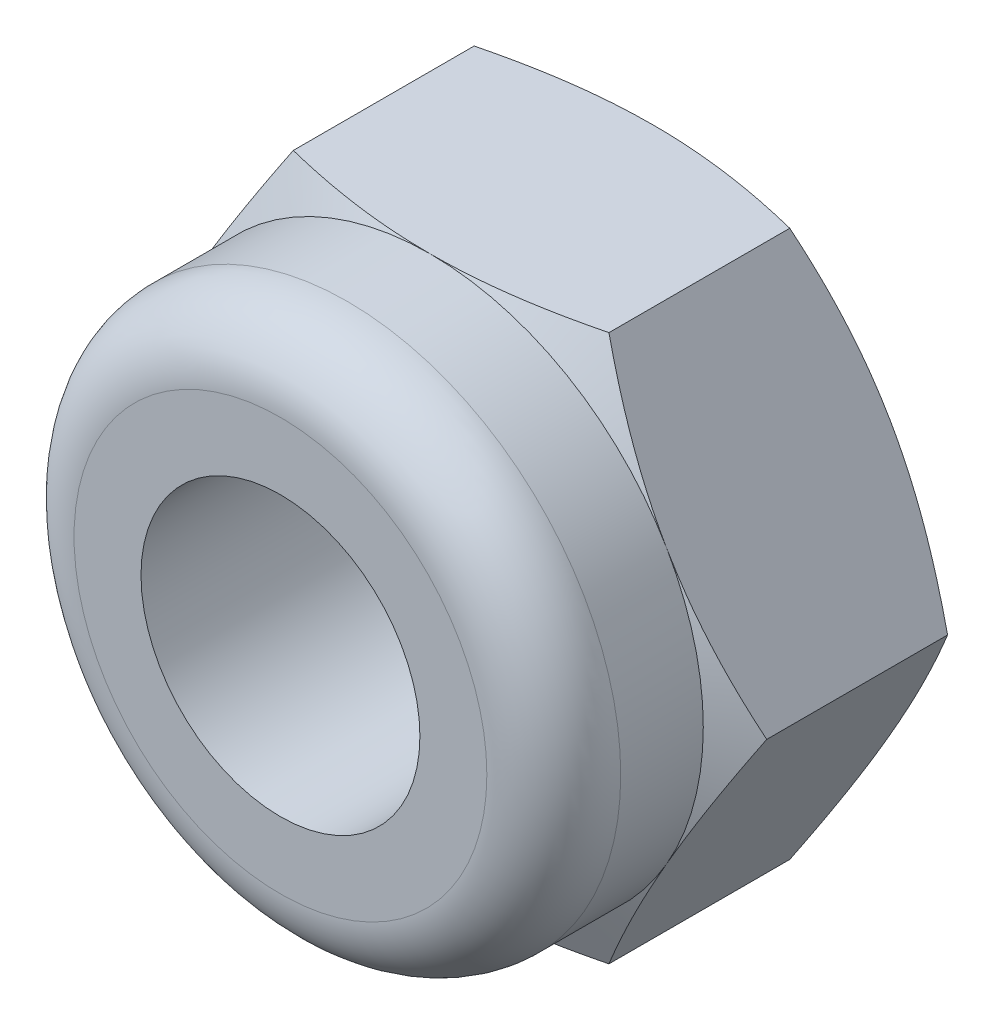
ISO-10303-21;
HEADER;
FILE_DESCRIPTION(('STEP AP214'),'2;1');
FILE_NAME('part.step','',(''),(''),'','','');
FILE_SCHEMA(('AUTOMOTIVE_DESIGN { 1 0 10303 214 1 1 1 1 }'));
ENDSEC;
DATA;
#1=APPLICATION_CONTEXT('core data for automotive mechanical design processes');
#2=APPLICATION_PROTOCOL_DEFINITION('international standard','automotive_design',2000,#1);
#3=PRODUCT_CONTEXT('',#1,'mechanical');
#4=PRODUCT('Part','Part','',(#3));
#5=PRODUCT_RELATED_PRODUCT_CATEGORY('part','',(#4));
#6=PRODUCT_DEFINITION_FORMATION('','',#4);
#7=PRODUCT_DEFINITION_CONTEXT('part definition',#1,'design');
#8=PRODUCT_DEFINITION('design','',#6,#7);
#9=PRODUCT_DEFINITION_SHAPE('','',#8);
#10=(LENGTH_UNIT() NAMED_UNIT(*) SI_UNIT(.MILLI.,.METRE.));
#11=(NAMED_UNIT(*) PLANE_ANGLE_UNIT() SI_UNIT($,.RADIAN.));
#12=(NAMED_UNIT(*) SI_UNIT($,.STERADIAN.) SOLID_ANGLE_UNIT());
#13=UNCERTAINTY_MEASURE_WITH_UNIT(LENGTH_MEASURE(1.E-05),#10,'distance_accuracy_value','');
#14=(GEOMETRIC_REPRESENTATION_CONTEXT(3) GLOBAL_UNCERTAINTY_ASSIGNED_CONTEXT((#13)) GLOBAL_UNIT_ASSIGNED_CONTEXT((#10,
#11,#12)) REPRESENTATION_CONTEXT('',''));
#15=CARTESIAN_POINT('',(0.,0.,0.));
#16=DIRECTION('',(0.,0.,1.));
#17=DIRECTION('',(1.,0.,0.));
#18=AXIS2_PLACEMENT_3D('',#15,#16,#17);
#19=CARTESIAN_POINT('',(0.,0.,0.));
#20=DIRECTION('',(0.,0.,1.));
#21=DIRECTION('',(1.,0.,0.));
#22=AXIS2_PLACEMENT_3D('',#19,#20,#21);
#23=PLANE('',#22);
#24=CARTESIAN_POINT('',(0.,0.,0.));
#25=DIRECTION('',(0.,0.,1.));
#26=DIRECTION('',(1.,0.,0.));
#27=AXIS2_PLACEMENT_3D('',#24,#25,#26);
#28=CIRCLE('',#27,1.55);
#29=CARTESIAN_POINT('',(1.55,0.,0.));
#30=VERTEX_POINT('',#29);
#31=EDGE_CURVE('E41',#30,#30,#28,.T.);
#32=ORIENTED_EDGE('',*,*,#31,.T.);
#33=EDGE_LOOP('',(#32));
#34=FACE_BOUND('',#33,.T.);
#35=CARTESIAN_POINT('',(0.,0.,0.));
#36=DIRECTION('',(0.,0.,1.));
#37=DIRECTION('',(1.,0.,0.));
#38=AXIS2_PLACEMENT_3D('',#35,#36,#37);
#39=CIRCLE('',#38,2.45);
#40=CARTESIAN_POINT('',(2.12176223927188,1.225,0.));
#41=VERTEX_POINT('',#40);
#42=CARTESIAN_POINT('',(0.,2.45,0.));
#43=VERTEX_POINT('',#42);
#44=EDGE_CURVE('E320',#41,#43,#39,.T.);
#45=ORIENTED_EDGE('',*,*,#44,.F.);
#46=CARTESIAN_POINT('',(2.12176223927188,-1.225,0.));
#47=VERTEX_POINT('',#46);
#48=EDGE_CURVE('E319',#47,#41,#39,.T.);
#49=ORIENTED_EDGE('',*,*,#48,.F.);
#50=CARTESIAN_POINT('',(0.,-2.45,0.));
#51=VERTEX_POINT('',#50);
#52=EDGE_CURVE('E310',#51,#47,#39,.T.);
#53=ORIENTED_EDGE('',*,*,#52,.F.);
#54=CARTESIAN_POINT('',(-2.12176223927188,-1.225,0.));
#55=VERTEX_POINT('',#54);
#56=EDGE_CURVE('E318',#55,#51,#39,.T.);
#57=ORIENTED_EDGE('',*,*,#56,.F.);
#58=CARTESIAN_POINT('',(-2.12176223927188,1.225,0.));
#59=VERTEX_POINT('',#58);
#60=EDGE_CURVE('E48',#59,#55,#39,.T.);
#61=ORIENTED_EDGE('',*,*,#60,.F.);
#62=EDGE_CURVE('E321',#43,#59,#39,.T.);
#63=ORIENTED_EDGE('',*,*,#62,.F.);
#64=EDGE_LOOP('',(#45,#49,#53,#57,#61,#63));
#65=FACE_BOUND('',#64,.T.);
#66=ADVANCED_FACE('F33',(#34,#65),#23,.F.);
#67=CARTESIAN_POINT('',(0.,0.,2.));
#68=DIRECTION('',(0.,0.,-1.));
#69=DIRECTION('',(-1.,0.,0.));
#70=AXIS2_PLACEMENT_3D('',#67,#68,#69);
#71=CYLINDRICAL_SURFACE('',#70,1.25);
#72=CARTESIAN_POINT('',(0.,0.,0.300000000000001));
#73=DIRECTION('',(0.,0.,1.));
#74=DIRECTION('',(1.,0.,0.));
#75=AXIS2_PLACEMENT_3D('',#72,#73,#74);
#76=CIRCLE('',#75,1.25);
#77=CARTESIAN_POINT('',(1.25,0.,0.300000000000001));
#78=VERTEX_POINT('',#77);
#79=EDGE_CURVE('E11',#78,#78,#76,.F.);
#80=ORIENTED_EDGE('',*,*,#79,.T.);
#81=EDGE_LOOP('',(#80));
#82=FACE_BOUND('',#81,.T.);
#83=CARTESIAN_POINT('',(0.,0.,3.34));
#84=DIRECTION('',(0.,0.,1.));
#85=DIRECTION('',(1.,0.,0.));
#86=AXIS2_PLACEMENT_3D('',#83,#84,#85);
#87=CIRCLE('',#86,1.25);
#88=CARTESIAN_POINT('',(1.25,0.,3.34));
#89=VERTEX_POINT('',#88);
#90=EDGE_CURVE('E145',#89,#89,#87,.T.);
#91=ORIENTED_EDGE('',*,*,#90,.T.);
#92=EDGE_LOOP('',(#91));
#93=FACE_BOUND('',#92,.T.);
#94=ADVANCED_FACE('F358',(#82,#93),#71,.F.);
#95=CARTESIAN_POINT('',(0.,0.,3.34));
#96=DIRECTION('',(0.,0.,1.));
#97=DIRECTION('',(1.,0.,0.));
#98=AXIS2_PLACEMENT_3D('',#95,#96,#97);
#99=PLANE('',#98);
#100=CARTESIAN_POINT('',(0.,0.,3.34));
#101=DIRECTION('',(0.,0.,1.));
#102=DIRECTION('',(1.,0.,0.));
#103=AXIS2_PLACEMENT_3D('',#100,#101,#102);
#104=CIRCLE('',#103,1.85);
#105=CARTESIAN_POINT('',(1.85,0.,3.34));
#106=VERTEX_POINT('',#105);
#107=EDGE_CURVE('E259',#106,#106,#104,.T.);
#108=ORIENTED_EDGE('',*,*,#107,.T.);
#109=EDGE_LOOP('',(#108));
#110=FACE_BOUND('',#109,.T.);
#111=ORIENTED_EDGE('',*,*,#90,.F.);
#112=EDGE_LOOP('',(#111));
#113=FACE_BOUND('',#112,.T.);
#114=ADVANCED_FACE('F188',(#110,#113),#99,.T.);
#115=CARTESIAN_POINT('',(0.,0.,3.34));
#116=DIRECTION('',(0.,0.,-1.));
#117=DIRECTION('',(-1.,0.,0.));
#118=AXIS2_PLACEMENT_3D('',#115,#116,#117);
#119=CYLINDRICAL_SURFACE('',#118,2.45);
#120=CARTESIAN_POINT('',(0.,0.,2.74));
#121=DIRECTION('',(0.,0.,1.));
#122=DIRECTION('',(1.,0.,0.));
#123=AXIS2_PLACEMENT_3D('',#120,#121,#122);
#124=CIRCLE('',#123,2.45);
#125=CARTESIAN_POINT('',(2.45,0.,2.74));
#126=VERTEX_POINT('',#125);
#127=EDGE_CURVE('E262',#126,#126,#124,.F.);
#128=ORIENTED_EDGE('',*,*,#127,.T.);
#129=EDGE_LOOP('',(#128));
#130=FACE_BOUND('',#129,.T.);
#131=CARTESIAN_POINT('',(0.,0.,2.));
#132=DIRECTION('',(0.,0.,1.));
#133=DIRECTION('',(1.,0.,0.));
#134=AXIS2_PLACEMENT_3D('',#131,#132,#133);
#135=CIRCLE('',#134,2.45);
#136=CARTESIAN_POINT('',(2.12176223927188,1.225,2.));
#137=VERTEX_POINT('',#136);
#138=CARTESIAN_POINT('',(0.,2.45,2.));
#139=VERTEX_POINT('',#138);
#140=EDGE_CURVE('E137',#137,#139,#135,.T.);
#141=ORIENTED_EDGE('',*,*,#140,.T.);
#142=CARTESIAN_POINT('',(-2.12176223927188,1.225,2.));
#143=VERTEX_POINT('',#142);
#144=EDGE_CURVE('E147',#139,#143,#135,.T.);
#145=ORIENTED_EDGE('',*,*,#144,.T.);
#146=CARTESIAN_POINT('',(-2.12176223927188,-1.225,2.));
#147=VERTEX_POINT('',#146);
#148=EDGE_CURVE('E338',#143,#147,#135,.T.);
#149=ORIENTED_EDGE('',*,*,#148,.T.);
#150=CARTESIAN_POINT('',(0.,-2.45,2.));
#151=VERTEX_POINT('',#150);
#152=EDGE_CURVE('E342',#147,#151,#135,.T.);
#153=ORIENTED_EDGE('',*,*,#152,.T.);
#154=CARTESIAN_POINT('',(2.12176223927188,-1.225,2.));
#155=VERTEX_POINT('',#154);
#156=EDGE_CURVE('E151',#151,#155,#135,.T.);
#157=ORIENTED_EDGE('',*,*,#156,.T.);
#158=EDGE_CURVE('E125',#155,#137,#135,.T.);
#159=ORIENTED_EDGE('',*,*,#158,.T.);
#160=EDGE_LOOP('',(#141,#145,#149,#153,#157,#159));
#161=FACE_BOUND('',#160,.T.);
#162=ADVANCED_FACE('F148',(#130,#161),#119,.T.);
#163=CARTESIAN_POINT('',(0.,0.,2.74));
#164=DIRECTION('',(0.,0.,1.));
#165=DIRECTION('',(1.,0.,0.));
#166=AXIS2_PLACEMENT_3D('',#163,#164,#165);
#167=TOROIDAL_SURFACE('',#166,1.85,0.6);
#168=ORIENTED_EDGE('',*,*,#127,.F.);
#169=EDGE_LOOP('',(#168));
#170=FACE_BOUND('',#169,.T.);
#171=ORIENTED_EDGE('',*,*,#107,.F.);
#172=EDGE_LOOP('',(#171));
#173=FACE_BOUND('',#172,.T.);
#174=ADVANCED_FACE('F183',(#170,#173),#167,.T.);
#175=CARTESIAN_POINT('',(0.,0.,2.));
#176=DIRECTION('',(0.,0.,-1.));
#177=DIRECTION('',(-1.,0.,0.));
#178=AXIS2_PLACEMENT_3D('',#175,#176,#177);
#179=CONICAL_SURFACE('',#178,2.45,1.10719917692415);
#180=CARTESIAN_POINT('',(-2.829131789083,0.0002,1.81045801464632));
#181=CARTESIAN_POINT('',(-2.78925045645928,-0.0688764943778407,1.83039085211696));
#182=CARTESIAN_POINT('',(-2.74922369150071,-0.138204884948706,1.84914505834999));
#183=CARTESIAN_POINT('',(-2.66885133900262,-0.277413882999241,1.88389230421213));
#184=CARTESIAN_POINT('',(-2.62850559835906,-0.347294755662878,1.89988392160782));
#185=CARTESIAN_POINT('',(-2.50691609941577,-0.557893945499499,1.94311244101173));
#186=CARTESIAN_POINT('',(-2.42521214727207,-0.699409341791562,1.96555504888077));
#187=CARTESIAN_POINT('',(-2.30308073202642,-0.910947158197323,1.98728850463863));
#188=CARTESIAN_POINT('',(-2.26290470634228,-0.980534075928443,1.99254971105909));
#189=CARTESIAN_POINT('',(-2.18247389048442,-1.11984433548847,1.99915007627289));
#190=CARTESIAN_POINT('',(-2.14221911174983,-1.18956765750422,2.00048976767063));
#191=CARTESIAN_POINT('',(-2.06176622653838,-1.32891614230597,1.99919124355789));
#192=CARTESIAN_POINT('',(-2.02156810329818,-1.3985413341269,1.99655694545281));
#193=CARTESIAN_POINT('',(-1.94128627619183,-1.53759353759957,1.98742080505591));
#194=CARTESIAN_POINT('',(-1.90120256286347,-1.60702056564031,1.98091929249445));
#195=CARTESIAN_POINT('',(-1.82374945956648,-1.74117327575457,1.96480892834782));
#196=CARTESIAN_POINT('',(-1.78636835975095,-1.80591923987788,1.95542197976972));
#197=CARTESIAN_POINT('',(-1.71181611056202,-1.93504752329164,1.93372657982642));
#198=CARTESIAN_POINT('',(-1.67464498399949,-1.99942980307251,1.92141781706377));
#199=CARTESIAN_POINT('',(-1.6001324211182,-2.12848934778509,1.89403325604483));
#200=CARTESIAN_POINT('',(-1.56279370609438,-2.19316189929568,1.87892813922739));
#201=CARTESIAN_POINT('',(-1.48839018559388,-2.32203257706454,1.84637238805776));
#202=CARTESIAN_POINT('',(-1.45132526059397,-2.38623091034311,1.8289228498953));
#203=CARTESIAN_POINT('',(-1.41439268946075,-2.4502,1.81045801464633));
#204=B_SPLINE_CURVE_WITH_KNOTS('',3,(#180,#181,#182,#183,#184,#185,#186,#187,#188,#189,#190,
#191,#192,#193,#194,#195,#196,#197,#198,#199,#200,#201,#202,#203),.UNSPECIFIED.,.F.,.F.,(4,2,2,
2,2,2,2,2,2,2,2,4),(0.,0.246623054565331,0.493372699441109,0.987441641289086,1.2289348544124,
1.47039526737633,1.71161781347347,1.95281979515711,2.17880540592537,2.40481511232698,
2.63334449795216,2.86176739872452),.UNSPECIFIED.);
#205=CARTESIAN_POINT('',(-2.82901631902917,0.,1.81051574592448));
#206=VERTEX_POINT('',#205);
#207=EDGE_CURVE('E287',#206,#147,#204,.T.);
#208=ORIENTED_EDGE('',*,*,#207,.T.);
#209=ORIENTED_EDGE('',*,*,#148,.F.);
#210=CARTESIAN_POINT('',(-1.41439268946075,2.4502,1.81045801464632));
#211=CARTESIAN_POINT('',(-1.45427402208447,2.38112350562216,1.83039085211696));
#212=CARTESIAN_POINT('',(-1.49430078704304,2.31179511505129,1.84914505834999));
#213=CARTESIAN_POINT('',(-1.57467313954114,2.17258611700076,1.88389230421213));
#214=CARTESIAN_POINT('',(-1.61501888018469,2.10270524433712,1.89988392160782));
#215=CARTESIAN_POINT('',(-1.73660837912798,1.8921060545005,1.94311244101173));
#216=CARTESIAN_POINT('',(-1.81831233127168,1.75059065820844,1.96555504888077));
#217=CARTESIAN_POINT('',(-1.94044374651733,1.53905284180268,1.98728850463863));
#218=CARTESIAN_POINT('',(-1.98061977220147,1.46946592407156,1.99254971105909));
#219=CARTESIAN_POINT('',(-2.06105058805933,1.33015566451153,1.99915007627289));
#220=CARTESIAN_POINT('',(-2.10130536679392,1.26043234249578,2.00048976767063));
#221=CARTESIAN_POINT('',(-2.18175825200538,1.12108385769403,1.99919124355789));
#222=CARTESIAN_POINT('',(-2.22195637524557,1.0514586658731,1.99655694545281));
#223=CARTESIAN_POINT('',(-2.30223820235193,0.91240646240043,1.98742080505591));
#224=CARTESIAN_POINT('',(-2.34232191568028,0.842979434359687,1.98091929249445));
#225=CARTESIAN_POINT('',(-2.41977501897727,0.708826724245427,1.96480892834782));
#226=CARTESIAN_POINT('',(-2.4571561187928,0.644080760122123,1.95542197976972));
#227=CARTESIAN_POINT('',(-2.53170836798173,0.51495247670836,1.93372657982642));
#228=CARTESIAN_POINT('',(-2.56887949454426,0.450570196927485,1.92141781706377));
#229=CARTESIAN_POINT('',(-2.64339205742556,0.321510652214911,1.89403325604483));
#230=CARTESIAN_POINT('',(-2.68073077244938,0.256838100704317,1.87892813922739));
#231=CARTESIAN_POINT('',(-2.75513429294988,0.127967422935458,1.84637238805776));
#232=CARTESIAN_POINT('',(-2.79219921794978,0.0637690896568933,1.8289228498953));
#233=CARTESIAN_POINT('',(-2.829131789083,-0.000200000000000828,1.81045801464633));
#234=B_SPLINE_CURVE_WITH_KNOTS('',3,(#210,#211,#212,#213,#214,#215,#216,#217,#218,#219,#220,
#221,#222,#223,#224,#225,#226,#227,#228,#229,#230,#231,#232,#233),.UNSPECIFIED.,.F.,.F.,(4,2,2,
2,2,2,2,2,2,2,2,4),(0.,0.246623054565331,0.49337269944111,0.987441641289087,1.2289348544124,
1.47039526737634,1.71161781347347,1.95281979515711,2.17880540592538,2.40481511232699,
2.63334449795216,2.86176739872452),.UNSPECIFIED.);
#235=EDGE_CURVE('E192',#143,#206,#234,.T.);
#236=ORIENTED_EDGE('',*,*,#235,.T.);
#237=EDGE_LOOP('',(#208,#209,#236));
#238=FACE_BOUND('',#237,.T.);
#239=ADVANCED_FACE('F177',(#238),#179,.T.);
#240=CARTESIAN_POINT('',(-3.7582041083325,2.45,0.981994568545175));
#241=CARTESIAN_POINT('',(-3.64833220363448,2.45,1.02799582935388));
#242=CARTESIAN_POINT('',(-3.53825188136879,2.45,1.07350850281742));
#243=CARTESIAN_POINT('',(-3.31756244929292,2.45,1.16327739904329));
#244=CARTESIAN_POINT('',(-3.20695326636109,2.45,1.20753344182512));
#245=CARTESIAN_POINT('',(-2.98468543538505,2.45,1.29466901404717));
#246=CARTESIAN_POINT('',(-2.87302436479426,2.45,1.33754238654812));
#247=CARTESIAN_POINT('',(-2.64897054427735,2.45,1.42132621627314));
#248=CARTESIAN_POINT('',(-2.53657782415993,2.45,1.46223675290521));
#249=CARTESIAN_POINT('',(-2.31241661272135,2.45,1.54105182187834));
#250=CARTESIAN_POINT('',(-2.20065969290659,2.45,1.57898909141165));
#251=CARTESIAN_POINT('',(-1.97613816040664,2.45,1.65180522055848));
#252=CARTESIAN_POINT('',(-1.86337347440045,2.45,1.68668385560877));
#253=CARTESIAN_POINT('',(-1.63684622009288,2.45,1.7525092047485));
#254=CARTESIAN_POINT('',(-1.5230851117513,2.45,1.78346088832861));
#255=CARTESIAN_POINT('',(-1.29434561007676,2.45,1.8404621854089));
#256=CARTESIAN_POINT('',(-1.17936736576877,2.45,1.86651239187339));
#257=CARTESIAN_POINT('',(-0.917273863711338,2.45,1.91869223465105));
#258=CARTESIAN_POINT('',(-0.769779936398422,2.45,1.94298351481865));
#259=CARTESIAN_POINT('',(-0.47331225462142,2.45,1.97941484702811));
#260=CARTESIAN_POINT('',(-0.324339167558712,2.45,1.99156014832091));
#261=CARTESIAN_POINT('',(-0.0253092813267779,2.45,2.00221110982476));
#262=CARTESIAN_POINT('',(0.124749482977573,2.45,2.00066430208001));
#263=CARTESIAN_POINT('',(0.424054823307712,2.45,1.98401888004633));
#264=CARTESIAN_POINT('',(0.573301487744078,2.45,1.96892177188102));
#265=CARTESIAN_POINT('',(0.937795776509915,2.45,1.91744558402853));
#266=CARTESIAN_POINT('',(1.15210238865569,2.45,1.8745007616788));
#267=CARTESIAN_POINT('',(1.47034081178898,2.45,1.79711022233652));
#268=CARTESIAN_POINT('',(1.57597128581171,2.45,1.76912200059794));
#269=CARTESIAN_POINT('',(1.7862471243022,2.45,1.70964300665318));
#270=CARTESIAN_POINT('',(1.89089253516941,2.45,1.6781524003244));
#271=CARTESIAN_POINT('',(2.10006967320321,2.45,1.61211994174751));
#272=CARTESIAN_POINT('',(2.20459464380037,2.45,1.57755694950257));
#273=CARTESIAN_POINT('',(2.41286394651225,2.45,1.50614647201502));
#274=CARTESIAN_POINT('',(2.51660824040984,2.45,1.46929887573766));
#275=CARTESIAN_POINT('',(2.82670154519109,2.45,1.35607811786053));
#276=CARTESIAN_POINT('',(3.03205359129044,2.45,1.2769805319284));
#277=CARTESIAN_POINT('',(3.44318881853842,2.45,1.11308820846422));
#278=CARTESIAN_POINT('',(3.64894972867638,2.45,1.02823835003588));
#279=CARTESIAN_POINT('',(4.05909530031379,2.45,0.855192842445367));
#280=CARTESIAN_POINT('',(4.26347972676682,2.45,0.766996638109221));
#281=CARTESIAN_POINT('',(4.66773944818013,2.45,0.589794981201157));
#282=CARTESIAN_POINT('',(4.86763215013244,2.45,0.500829056000529));
#283=CARTESIAN_POINT('',(5.26660253547478,2.45,0.321234808573496));
#284=CARTESIAN_POINT('',(5.46568043276179,2.45,0.230606962115584));
#285=CARTESIAN_POINT('',(5.66449641705126,2.45,0.139419618358929));
#286=B_SPLINE_CURVE_WITH_KNOTS('',3,(#240,#241,#242,#243,#244,#245,#246,#247,#248,#249,#250,
#251,#252,#253,#254,#255,#256,#257,#258,#259,#260,#261,#262,#263,#264,#265,#266,#267,#268,#269,
#270,#271,#272,#273,#274,#275,#276,#277,#278,#279,#280,#281,#282,#283,#284,#285),.UNSPECIFIED.,
.F.,.F.,(4,2,2,2,2,2,2,2,2,2,2,2,2,2,2,2,2,2,2,2,2,2,4),(0.,0.357343704764189,0.714738334406811,
1.07355071742388,1.4323485721542,1.78637553787836,2.14042847434147,2.4940287964133,
2.84758631355786,3.2956068237274,3.74343362454178,4.19297723160823,4.64247087783306,
5.29695731608934,5.62475513164808,5.95253742889007,6.28278152543918,6.61304168488326,
7.27311233863229,7.94078475477396,8.60856842934929,9.26495050890703,9.92114752796325),.UNSPECIFIED.);
#287=CARTESIAN_POINT('',(-1.41450815951459,2.45,1.81051574592448));
#288=VERTEX_POINT('',#287);
#289=EDGE_CURVE('E158',#139,#288,#286,.F.);
#290=ORIENTED_EDGE('',*,*,#289,.T.);
#291=EDGE_CURVE('E322',#288,#143,#234,.T.);
#292=ORIENTED_EDGE('',*,*,#291,.T.);
#293=ORIENTED_EDGE('',*,*,#144,.F.);
#294=EDGE_LOOP('',(#290,#292,#293));
#295=FACE_BOUND('',#294,.T.);
#296=ADVANCED_FACE('F182',(#295),#179,.T.);
#297=CARTESIAN_POINT('',(2.829131789083,-0.0002,1.81045801464632));
#298=CARTESIAN_POINT('',(2.78925045645928,0.068876494377841,1.83039085211696));
#299=CARTESIAN_POINT('',(2.74922369150071,0.138204884948706,1.84914505834999));
#300=CARTESIAN_POINT('',(2.66885133900262,0.277413882999241,1.88389230421213));
#301=CARTESIAN_POINT('',(2.62850559835906,0.347294755662879,1.89988392160782));
#302=CARTESIAN_POINT('',(2.50691609941577,0.557893945499499,1.94311244101173));
#303=CARTESIAN_POINT('',(2.42521214727207,0.699409341791563,1.96555504888077));
#304=CARTESIAN_POINT('',(2.30308073202642,0.910947158197323,1.98728850463863));
#305=CARTESIAN_POINT('',(2.26290470634228,0.980534075928444,1.99254971105909));
#306=CARTESIAN_POINT('',(2.18247389048442,1.11984433548847,1.99915007627289));
#307=CARTESIAN_POINT('',(2.14221911174983,1.18956765750422,2.00048976767063));
#308=CARTESIAN_POINT('',(2.06176622653837,1.32891614230597,1.99919124355789));
#309=CARTESIAN_POINT('',(2.02156810329818,1.3985413341269,1.99655694545281));
#310=CARTESIAN_POINT('',(1.94128627619183,1.53759353759957,1.98742080505591));
#311=CARTESIAN_POINT('',(1.90120256286347,1.60702056564031,1.98091929249445));
#312=CARTESIAN_POINT('',(1.82374945956648,1.74117327575457,1.96480892834782));
#313=CARTESIAN_POINT('',(1.78636835975095,1.80591923987788,1.95542197976972));
#314=CARTESIAN_POINT('',(1.71181611056202,1.93504752329164,1.93372657982642));
#315=CARTESIAN_POINT('',(1.67464498399949,1.99942980307251,1.92141781706377));
#316=CARTESIAN_POINT('',(1.60013242111819,2.12848934778509,1.89403325604483));
#317=CARTESIAN_POINT('',(1.56279370609437,2.19316189929568,1.87892813922739));
#318=CARTESIAN_POINT('',(1.48839018559387,2.32203257706454,1.84637238805776));
#319=CARTESIAN_POINT('',(1.45132526059397,2.38623091034311,1.8289228498953));
#320=CARTESIAN_POINT('',(1.41439268946074,2.4502,1.81045801464633));
#321=B_SPLINE_CURVE_WITH_KNOTS('',3,(#297,#298,#299,#300,#301,#302,#303,#304,#305,#306,#307,
#308,#309,#310,#311,#312,#313,#314,#315,#316,#317,#318,#319,#320),.UNSPECIFIED.,.F.,.F.,(4,2,2,
2,2,2,2,2,2,2,2,4),(0.,0.246623054565331,0.49337269944111,0.987441641289087,1.2289348544124,
1.47039526737633,1.71161781347347,1.95281979515711,2.17880540592537,2.40481511232699,
2.63334449795216,2.86176739872452),.UNSPECIFIED.);
#322=CARTESIAN_POINT('',(1.41450815951458,2.45,1.81051574592448));
#323=VERTEX_POINT('',#322);
#324=EDGE_CURVE('E133',#137,#323,#321,.T.);
#325=ORIENTED_EDGE('',*,*,#324,.T.);
#326=EDGE_CURVE('E140',#323,#139,#286,.F.);
#327=ORIENTED_EDGE('',*,*,#326,.T.);
#328=ORIENTED_EDGE('',*,*,#140,.F.);
#329=EDGE_LOOP('',(#325,#327,#328));
#330=FACE_BOUND('',#329,.T.);
#331=ADVANCED_FACE('F138',(#330),#179,.T.);
#332=CARTESIAN_POINT('',(1.41439268946075,-2.4502,1.81045801464632));
#333=CARTESIAN_POINT('',(1.45427402208447,-2.38112350562216,1.83039085211696));
#334=CARTESIAN_POINT('',(1.49430078704304,-2.31179511505129,1.84914505834999));
#335=CARTESIAN_POINT('',(1.57467313954114,-2.17258611700076,1.88389230421213));
#336=CARTESIAN_POINT('',(1.61501888018469,-2.10270524433712,1.89988392160782));
#337=CARTESIAN_POINT('',(1.73660837912798,-1.8921060545005,1.94311244101173));
#338=CARTESIAN_POINT('',(1.81831233127168,-1.75059065820844,1.96555504888077));
#339=CARTESIAN_POINT('',(1.94044374651733,-1.53905284180268,1.98728850463863));
#340=CARTESIAN_POINT('',(1.98061977220147,-1.46946592407156,1.99254971105909));
#341=CARTESIAN_POINT('',(2.06105058805933,-1.33015566451153,1.99915007627289));
#342=CARTESIAN_POINT('',(2.10130536679392,-1.26043234249578,2.00048976767063));
#343=CARTESIAN_POINT('',(2.18175825200538,-1.12108385769403,1.99919124355789));
#344=CARTESIAN_POINT('',(2.22195637524557,-1.0514586658731,1.99655694545281));
#345=CARTESIAN_POINT('',(2.30223820235193,-0.91240646240043,1.98742080505591));
#346=CARTESIAN_POINT('',(2.34232191568028,-0.842979434359687,1.98091929249445));
#347=CARTESIAN_POINT('',(2.41977501897727,-0.708826724245427,1.96480892834782));
#348=CARTESIAN_POINT('',(2.4571561187928,-0.644080760122123,1.95542197976972));
#349=CARTESIAN_POINT('',(2.53170836798173,-0.51495247670836,1.93372657982642));
#350=CARTESIAN_POINT('',(2.56887949454426,-0.450570196927485,1.92141781706377));
#351=CARTESIAN_POINT('',(2.64339205742556,-0.321510652214911,1.89403325604483));
#352=CARTESIAN_POINT('',(2.68073077244938,-0.256838100704317,1.87892813922739));
#353=CARTESIAN_POINT('',(2.75513429294988,-0.127967422935458,1.84637238805776));
#354=CARTESIAN_POINT('',(2.79219921794978,-0.0637690896568933,1.8289228498953));
#355=CARTESIAN_POINT('',(2.829131789083,0.000200000000000828,1.81045801464633));
#356=B_SPLINE_CURVE_WITH_KNOTS('',3,(#332,#333,#334,#335,#336,#337,#338,#339,#340,#341,#342,
#343,#344,#345,#346,#347,#348,#349,#350,#351,#352,#353,#354,#355),.UNSPECIFIED.,.F.,.F.,(4,2,2,
2,2,2,2,2,2,2,2,4),(0.,0.246623054565331,0.49337269944111,0.987441641289087,1.2289348544124,
1.47039526737634,1.71161781347347,1.95281979515711,2.17880540592538,2.40481511232699,
2.63334449795216,2.86176739872452),.UNSPECIFIED.);
#357=CARTESIAN_POINT('',(2.82901631902917,0.,1.81051574592448));
#358=VERTEX_POINT('',#357);
#359=EDGE_CURVE('E128',#155,#358,#356,.T.);
#360=ORIENTED_EDGE('',*,*,#359,.T.);
#361=EDGE_CURVE('E121',#358,#137,#321,.T.);
#362=ORIENTED_EDGE('',*,*,#361,.T.);
#363=ORIENTED_EDGE('',*,*,#158,.F.);
#364=EDGE_LOOP('',(#360,#362,#363));
#365=FACE_BOUND('',#364,.T.);
#366=ADVANCED_FACE('F123',(#365),#179,.T.);
#367=CARTESIAN_POINT('',(-3.7582041083325,-2.45,0.981994568545175));
#368=CARTESIAN_POINT('',(-3.64833220363448,-2.45,1.02799582935388));
#369=CARTESIAN_POINT('',(-3.53825188136879,-2.45,1.07350850281742));
#370=CARTESIAN_POINT('',(-3.31756244929292,-2.45,1.16327739904329));
#371=CARTESIAN_POINT('',(-3.20695326636109,-2.45,1.20753344182512));
#372=CARTESIAN_POINT('',(-2.98468543538505,-2.45,1.29466901404717));
#373=CARTESIAN_POINT('',(-2.87302436479426,-2.45,1.33754238654812));
#374=CARTESIAN_POINT('',(-2.64897054427735,-2.45,1.42132621627314));
#375=CARTESIAN_POINT('',(-2.53657782415993,-2.45,1.46223675290521));
#376=CARTESIAN_POINT('',(-2.31241661272135,-2.45,1.54105182187834));
#377=CARTESIAN_POINT('',(-2.20065969290659,-2.45,1.57898909141165));
#378=CARTESIAN_POINT('',(-1.97613816040664,-2.45,1.65180522055848));
#379=CARTESIAN_POINT('',(-1.86337347440045,-2.45,1.68668385560877));
#380=CARTESIAN_POINT('',(-1.63684622009288,-2.45,1.7525092047485));
#381=CARTESIAN_POINT('',(-1.5230851117513,-2.45,1.78346088832861));
#382=CARTESIAN_POINT('',(-1.29434561007676,-2.45,1.8404621854089));
#383=CARTESIAN_POINT('',(-1.17936736576877,-2.45,1.86651239187339));
#384=CARTESIAN_POINT('',(-0.917273863711338,-2.45,1.91869223465105));
#385=CARTESIAN_POINT('',(-0.769779936398421,-2.45,1.94298351481865));
#386=CARTESIAN_POINT('',(-0.47331225462142,-2.45,1.97941484702811));
#387=CARTESIAN_POINT('',(-0.324339167558712,-2.45,1.99156014832091));
#388=CARTESIAN_POINT('',(-0.0253092813267776,-2.45,2.00221110982476));
#389=CARTESIAN_POINT('',(0.124749482977574,-2.45,2.00066430208001));
#390=CARTESIAN_POINT('',(0.424054823307712,-2.45,1.98401888004633));
#391=CARTESIAN_POINT('',(0.573301487744079,-2.45,1.96892177188102));
#392=CARTESIAN_POINT('',(0.937795776509915,-2.45,1.91744558402853));
#393=CARTESIAN_POINT('',(1.15210238865569,-2.45,1.87450076167879));
#394=CARTESIAN_POINT('',(1.47034081178898,-2.45,1.79711022233652));
#395=CARTESIAN_POINT('',(1.57597128581172,-2.45,1.76912200059794));
#396=CARTESIAN_POINT('',(1.7862471243022,-2.45,1.70964300665318));
#397=CARTESIAN_POINT('',(1.89089253516941,-2.45,1.6781524003244));
#398=CARTESIAN_POINT('',(2.10006967320321,-2.45,1.61211994174751));
#399=CARTESIAN_POINT('',(2.20459464380037,-2.45,1.57755694950257));
#400=CARTESIAN_POINT('',(2.41286394651225,-2.45,1.50614647201502));
#401=CARTESIAN_POINT('',(2.51660824040984,-2.45,1.46929887573766));
#402=CARTESIAN_POINT('',(2.82670154519109,-2.45,1.35607811786053));
#403=CARTESIAN_POINT('',(3.03205359129045,-2.45,1.2769805319284));
#404=CARTESIAN_POINT('',(3.44318881853842,-2.45,1.11308820846421));
#405=CARTESIAN_POINT('',(3.64894972867638,-2.45,1.02823835003588));
#406=CARTESIAN_POINT('',(4.05909530031379,-2.45,0.855192842445366));
#407=CARTESIAN_POINT('',(4.26347972676682,-2.45,0.76699663810922));
#408=CARTESIAN_POINT('',(4.66773944818013,-2.45,0.589794981201156));
#409=CARTESIAN_POINT('',(4.86763215013244,-2.45,0.500829056000527));
#410=CARTESIAN_POINT('',(5.26660253547479,-2.45,0.321234808573494));
#411=CARTESIAN_POINT('',(5.4656804327618,-2.45,0.230606962115582));
#412=CARTESIAN_POINT('',(5.66449641705126,-2.45,0.139419618358927));
#413=B_SPLINE_CURVE_WITH_KNOTS('',3,(#367,#368,#369,#370,#371,#372,#373,#374,#375,#376,#377,
#378,#379,#380,#381,#382,#383,#384,#385,#386,#387,#388,#389,#390,#391,#392,#393,#394,#395,#396,
#397,#398,#399,#400,#401,#402,#403,#404,#405,#406,#407,#408,#409,#410,#411,#412),.UNSPECIFIED.,
.F.,.F.,(4,2,2,2,2,2,2,2,2,2,2,2,2,2,2,2,2,2,2,2,2,2,4),(0.,0.357343704764189,0.714738334406811,
1.07355071742388,1.4323485721542,1.78637553787836,2.14042847434147,2.4940287964133,
2.84758631355786,3.2956068237274,3.74343362454178,4.19297723160823,4.64247087783306,
5.29695731608934,5.62475513164808,5.95253742889007,6.28278152543919,6.61304168488326,
7.27311233863229,7.94078475477397,8.6085684293493,9.26495050890704,9.92114752796325),.UNSPECIFIED.);
#414=CARTESIAN_POINT('',(1.41450815951459,-2.45,1.81051574592448));
#415=VERTEX_POINT('',#414);
#416=EDGE_CURVE('E202',#151,#415,#413,.T.);
#417=ORIENTED_EDGE('',*,*,#416,.T.);
#418=EDGE_CURVE('E208',#415,#155,#356,.T.);
#419=ORIENTED_EDGE('',*,*,#418,.T.);
#420=ORIENTED_EDGE('',*,*,#156,.F.);
#421=EDGE_LOOP('',(#417,#419,#420));
#422=FACE_BOUND('',#421,.T.);
#423=ADVANCED_FACE('F345',(#422),#179,.T.);
#424=CARTESIAN_POINT('',(-1.4145081595148,-2.45,1.81051574592466));
#425=VERTEX_POINT('',#424);
#426=EDGE_CURVE('E209',#147,#425,#204,.T.);
#427=ORIENTED_EDGE('',*,*,#426,.T.);
#428=EDGE_CURVE('E207',#425,#151,#413,.T.);
#429=ORIENTED_EDGE('',*,*,#428,.T.);
#430=ORIENTED_EDGE('',*,*,#152,.F.);
#431=EDGE_LOOP('',(#427,#429,#430));
#432=FACE_BOUND('',#431,.T.);
#433=ADVANCED_FACE('F185',(#432),#179,.T.);
#434=CARTESIAN_POINT('',(-1.41450815951459,2.45,2.));
#435=DIRECTION('',(0.866025403784439,-0.499999999999999,0.));
#436=DIRECTION('',(0.499999999999999,0.866025403784439,0.));
#437=AXIS2_PLACEMENT_3D('',#434,#435,#436);
#438=PLANE('',#437);
#439=ORIENTED_EDGE('',*,*,#291,.F.);
#440=DIRECTION('',(0.,0.,-1.));
#441=VECTOR('',#440,1.);
#442=CARTESIAN_POINT('',(-1.41450815951459,2.45,2.));
#443=LINE('',#442,#441);
#444=CARTESIAN_POINT('',(-1.41450815951459,2.45,0.189484254075518));
#445=VERTEX_POINT('',#444);
#446=EDGE_CURVE('E248',#288,#445,#443,.T.);
#447=ORIENTED_EDGE('',*,*,#446,.T.);
#448=CARTESIAN_POINT('',(-2.829131789083,-0.0002,0.18954198535368));
#449=CARTESIAN_POINT('',(-2.78925045645928,0.0688764943778409,0.169609147883037));
#450=CARTESIAN_POINT('',(-2.74922369150071,0.138204884948706,0.150854941650007));
#451=CARTESIAN_POINT('',(-2.66885133900262,0.277413882999241,0.116107695787867));
#452=CARTESIAN_POINT('',(-2.62850559835906,0.347294755662879,0.100116078392179));
#453=CARTESIAN_POINT('',(-2.50691609941577,0.557893945499499,0.0568875589882661));
#454=CARTESIAN_POINT('',(-2.42521214727207,0.699409341791563,0.034444951119226));
#455=CARTESIAN_POINT('',(-2.30308073202642,0.910947158197323,0.0127114953613684));
#456=CARTESIAN_POINT('',(-2.26290470634228,0.980534075928443,0.00745028894090671));
#457=CARTESIAN_POINT('',(-2.18247389048442,1.11984433548847,0.000849923727108085));
#458=CARTESIAN_POINT('',(-2.14221911174983,1.18956765750422,-0.000489767670631829));
#459=CARTESIAN_POINT('',(-2.06176622653838,1.32891614230597,0.000808756442110749));
#460=CARTESIAN_POINT('',(-2.02156810329818,1.3985413341269,0.00344305454718719));
#461=CARTESIAN_POINT('',(-1.94128627619183,1.53759353759957,0.0125791949440857));
#462=CARTESIAN_POINT('',(-1.90120256286347,1.60702056564031,0.0190807075055511));
#463=CARTESIAN_POINT('',(-1.82374945956648,1.74117327575457,0.0351910716521812));
#464=CARTESIAN_POINT('',(-1.78636835975095,1.80591923987788,0.0445780202302811));
#465=CARTESIAN_POINT('',(-1.71181611056202,1.93504752329164,0.0662734201735822));
#466=CARTESIAN_POINT('',(-1.67464498399949,1.99942980307251,0.0785821829362343));
#467=CARTESIAN_POINT('',(-1.6001324211182,2.12848934778509,0.105966743955169));
#468=CARTESIAN_POINT('',(-1.56279370609438,2.19316189929568,0.121071860772611));
#469=CARTESIAN_POINT('',(-1.48839018559388,2.32203257706454,0.153627611942243));
#470=CARTESIAN_POINT('',(-1.45132526059397,2.38623091034311,0.171077150104703));
#471=CARTESIAN_POINT('',(-1.41439268946075,2.4502,0.189541985353673));
#472=B_SPLINE_CURVE_WITH_KNOTS('',3,(#448,#449,#450,#451,#452,#453,#454,#455,#456,#457,#458,
#459,#460,#461,#462,#463,#464,#465,#466,#467,#468,#469,#470,#471),.UNSPECIFIED.,.F.,.F.,(4,2,2,
2,2,2,2,2,2,2,2,4),(0.,0.246623054565331,0.49337269944111,0.987441641289087,1.2289348544124,
1.47039526737633,1.71161781347347,1.95281979515711,2.17880540592537,2.40481511232698,
2.63334449795216,2.86176739872452),.UNSPECIFIED.);
#473=EDGE_CURVE('E265',#59,#445,#472,.T.);
#474=ORIENTED_EDGE('',*,*,#473,.F.);
#475=CARTESIAN_POINT('',(-2.82901631902917,0.,0.189484254075518));
#476=VERTEX_POINT('',#475);
#477=EDGE_CURVE('E52',#476,#59,#472,.T.);
#478=ORIENTED_EDGE('',*,*,#477,.F.);
#479=DIRECTION('',(0.,0.,-1.));
#480=VECTOR('',#479,1.);
#481=CARTESIAN_POINT('',(-2.82901631902917,0.,2.));
#482=LINE('',#481,#480);
#483=EDGE_CURVE('E144',#206,#476,#482,.T.);
#484=ORIENTED_EDGE('',*,*,#483,.F.);
#485=ORIENTED_EDGE('',*,*,#235,.F.);
#486=EDGE_LOOP('',(#439,#447,#474,#478,#484,#485));
#487=FACE_BOUND('',#486,.T.);
#488=ADVANCED_FACE('F269',(#487),#438,.F.);
#489=CARTESIAN_POINT('',(-1.41450815951459,2.45,2.));
#490=DIRECTION('',(0.,-1.,0.));
#491=DIRECTION('',(0.,0.,-1.));
#492=AXIS2_PLACEMENT_3D('',#489,#490,#491);
#493=PLANE('',#492);
#494=ORIENTED_EDGE('',*,*,#326,.F.);
#495=DIRECTION('',(0.,0.,-1.));
#496=VECTOR('',#495,1.);
#497=CARTESIAN_POINT('',(1.41450815951458,2.45,2.));
#498=LINE('',#497,#496);
#499=CARTESIAN_POINT('',(1.41450815951458,2.45,0.189484254075518));
#500=VERTEX_POINT('',#499);
#501=EDGE_CURVE('E157',#323,#500,#498,.T.);
#502=ORIENTED_EDGE('',*,*,#501,.T.);
#503=CARTESIAN_POINT('',(-3.7582041083325,2.45,1.01800543145483));
#504=CARTESIAN_POINT('',(-3.64833220363448,2.45,0.972004170646115));
#505=CARTESIAN_POINT('',(-3.53825188136879,2.45,0.92649149718258));
#506=CARTESIAN_POINT('',(-3.31756244929292,2.45,0.836722600956715));
#507=CARTESIAN_POINT('',(-3.20695326636109,2.45,0.792466558174882));
#508=CARTESIAN_POINT('',(-2.98468543538505,2.45,0.705330985952829));
#509=CARTESIAN_POINT('',(-2.87302436479426,2.45,0.662457613451879));
#510=CARTESIAN_POINT('',(-2.64897054427735,2.45,0.578673783726863));
#511=CARTESIAN_POINT('',(-2.53657782415993,2.45,0.53776324709479));
#512=CARTESIAN_POINT('',(-2.31241661272135,2.45,0.458948178121665));
#513=CARTESIAN_POINT('',(-2.20065969290659,2.45,0.421010908588355));
#514=CARTESIAN_POINT('',(-1.97613816040664,2.45,0.348194779441516));
#515=CARTESIAN_POINT('',(-1.86337347440045,2.45,0.313316144391227));
#516=CARTESIAN_POINT('',(-1.63684622009288,2.45,0.247490795251501));
#517=CARTESIAN_POINT('',(-1.5230851117513,2.45,0.216539111671391));
#518=CARTESIAN_POINT('',(-1.29434561007676,2.45,0.159537814591099));
#519=CARTESIAN_POINT('',(-1.17936736576877,2.45,0.133487608126609));
#520=CARTESIAN_POINT('',(-0.917273863711338,2.45,0.0813077653489491));
#521=CARTESIAN_POINT('',(-0.769779936398421,2.45,0.0570164851813502));
#522=CARTESIAN_POINT('',(-0.47331225462142,2.45,0.0205851529718884));
#523=CARTESIAN_POINT('',(-0.324339167558712,2.45,0.00843985167908709));
#524=CARTESIAN_POINT('',(-0.025309281326778,2.45,-0.00221110982475766));
#525=CARTESIAN_POINT('',(0.124749482977573,2.45,-0.000664302080013533));
#526=CARTESIAN_POINT('',(0.424054823307712,2.45,0.0159811199536713));
#527=CARTESIAN_POINT('',(0.573301487744078,2.45,0.0310782281189823));
#528=CARTESIAN_POINT('',(0.937795776509915,2.45,0.0825544159714652));
#529=CARTESIAN_POINT('',(1.15210238865569,2.45,0.125499238321205));
#530=CARTESIAN_POINT('',(1.47034081178898,2.45,0.20288977766348));
#531=CARTESIAN_POINT('',(1.57597128581172,2.45,0.23087799940206));
#532=CARTESIAN_POINT('',(1.7862471243022,2.45,0.290356993346822));
#533=CARTESIAN_POINT('',(1.89089253516941,2.45,0.321847599675603));
#534=CARTESIAN_POINT('',(2.10006967320321,2.45,0.38788005825249));
#535=CARTESIAN_POINT('',(2.20459464380037,2.45,0.422443050497428));
#536=CARTESIAN_POINT('',(2.41286394651225,2.45,0.493853527984981));
#537=CARTESIAN_POINT('',(2.51660824040984,2.45,0.530701124262336));
#538=CARTESIAN_POINT('',(2.82670154519109,2.45,0.643921882139471));
#539=CARTESIAN_POINT('',(3.03205359129045,2.45,0.723019468071597));
#540=CARTESIAN_POINT('',(3.44318881853842,2.45,0.886911791535785));
#541=CARTESIAN_POINT('',(3.64894972867638,2.45,0.971761649964121));
#542=CARTESIAN_POINT('',(4.05909530031379,2.45,1.14480715755463));
#543=CARTESIAN_POINT('',(4.26347972676682,2.45,1.23300336189078));
#544=CARTESIAN_POINT('',(4.66773944818013,2.45,1.41020501879884));
#545=CARTESIAN_POINT('',(4.86763215013244,2.45,1.49917094399947));
#546=CARTESIAN_POINT('',(5.26660253547478,2.45,1.6787651914265));
#547=CARTESIAN_POINT('',(5.46568043276179,2.45,1.76939303788442));
#548=CARTESIAN_POINT('',(5.66449641705126,2.45,1.86058038164107));
#549=B_SPLINE_CURVE_WITH_KNOTS('',3,(#503,#504,#505,#506,#507,#508,#509,#510,#511,#512,#513,
#514,#515,#516,#517,#518,#519,#520,#521,#522,#523,#524,#525,#526,#527,#528,#529,#530,#531,#532,
#533,#534,#535,#536,#537,#538,#539,#540,#541,#542,#543,#544,#545,#546,#547,#548),.UNSPECIFIED.,
.F.,.F.,(4,2,2,2,2,2,2,2,2,2,2,2,2,2,2,2,2,2,2,2,2,2,4),(0.,0.357343704764189,0.714738334406811,
1.07355071742388,1.4323485721542,1.78637553787836,2.14042847434147,2.4940287964133,
2.84758631355786,3.2956068237274,3.74343362454178,4.19297723160823,4.64247087783306,
5.29695731608934,5.62475513164808,5.95253742889008,6.28278152543918,6.61304168488326,
7.27311233863229,7.94078475477396,8.60856842934929,9.26495050890703,9.92114752796325),.UNSPECIFIED.);
#550=EDGE_CURVE('E288',#43,#500,#549,.T.);
#551=ORIENTED_EDGE('',*,*,#550,.F.);
#552=EDGE_CURVE('E281',#445,#43,#549,.T.);
#553=ORIENTED_EDGE('',*,*,#552,.F.);
#554=ORIENTED_EDGE('',*,*,#446,.F.);
#555=ORIENTED_EDGE('',*,*,#289,.F.);
#556=EDGE_LOOP('',(#494,#502,#551,#553,#554,#555));
#557=FACE_BOUND('',#556,.T.);
#558=ADVANCED_FACE('F273',(#557),#493,.F.);
#559=CARTESIAN_POINT('',(1.41450815951458,2.45,2.));
#560=DIRECTION('',(-0.866025403784439,-0.5,0.));
#561=DIRECTION('',(0.5,-0.866025403784439,0.));
#562=AXIS2_PLACEMENT_3D('',#559,#560,#561);
#563=PLANE('',#562);
#564=ORIENTED_EDGE('',*,*,#361,.F.);
#565=DIRECTION('',(0.,0.,-1.));
#566=VECTOR('',#565,1.);
#567=CARTESIAN_POINT('',(2.82901631902917,0.,2.));
#568=LINE('',#567,#566);
#569=CARTESIAN_POINT('',(2.82901631902917,0.,0.189484254075518));
#570=VERTEX_POINT('',#569);
#571=EDGE_CURVE('E252',#358,#570,#568,.T.);
#572=ORIENTED_EDGE('',*,*,#571,.T.);
#573=CARTESIAN_POINT('',(1.41439268946075,2.4502,0.18954198535368));
#574=CARTESIAN_POINT('',(1.45427402208447,2.38112350562216,0.169609147883037));
#575=CARTESIAN_POINT('',(1.49430078704304,2.31179511505129,0.150854941650007));
#576=CARTESIAN_POINT('',(1.57467313954113,2.17258611700076,0.116107695787866));
#577=CARTESIAN_POINT('',(1.61501888018469,2.10270524433712,0.100116078392178));
#578=CARTESIAN_POINT('',(1.73660837912798,1.8921060545005,0.056887558988266));
#579=CARTESIAN_POINT('',(1.81831233127168,1.75059065820844,0.0344449511192259));
#580=CARTESIAN_POINT('',(1.94044374651733,1.53905284180268,0.0127114953613681));
#581=CARTESIAN_POINT('',(1.98061977220147,1.46946592407156,0.00745028894090629));
#582=CARTESIAN_POINT('',(2.06105058805933,1.33015566451153,0.000849923727107601));
#583=CARTESIAN_POINT('',(2.10130536679392,1.26043234249578,-0.000489767670632267));
#584=CARTESIAN_POINT('',(2.18175825200538,1.12108385769403,0.00080875644211033));
#585=CARTESIAN_POINT('',(2.22195637524557,1.0514586658731,0.00344305454718672));
#586=CARTESIAN_POINT('',(2.30223820235192,0.912406462400431,0.0125791949440852));
#587=CARTESIAN_POINT('',(2.34232191568028,0.842979434359688,0.0190807075055508));
#588=CARTESIAN_POINT('',(2.41977501897727,0.708826724245429,0.0351910716521808));
#589=CARTESIAN_POINT('',(2.4571561187928,0.644080760122124,0.0445780202302805));
#590=CARTESIAN_POINT('',(2.53170836798173,0.514952476708361,0.0662734201735816));
#591=CARTESIAN_POINT('',(2.56887949454426,0.450570196927486,0.0785821829362338));
#592=CARTESIAN_POINT('',(2.64339205742556,0.321510652214911,0.105966743955169));
#593=CARTESIAN_POINT('',(2.68073077244938,0.256838100704317,0.121071860772611));
#594=CARTESIAN_POINT('',(2.75513429294988,0.127967422935459,0.153627611942242));
#595=CARTESIAN_POINT('',(2.79219921794978,0.0637690896568936,0.171077150104703));
#596=CARTESIAN_POINT('',(2.82913178908301,-0.000200000000000808,0.189541985353673));
#597=B_SPLINE_CURVE_WITH_KNOTS('',3,(#573,#574,#575,#576,#577,#578,#579,#580,#581,#582,#583,
#584,#585,#586,#587,#588,#589,#590,#591,#592,#593,#594,#595,#596),.UNSPECIFIED.,.F.,.F.,(4,2,2,
2,2,2,2,2,2,2,2,4),(0.,0.246623054565332,0.49337269944111,0.987441641289087,1.2289348544124,
1.47039526737634,1.71161781347347,1.95281979515711,2.17880540592537,2.40481511232699,
2.63334449795216,2.86176739872452),.UNSPECIFIED.);
#598=EDGE_CURVE('E243',#41,#570,#597,.T.);
#599=ORIENTED_EDGE('',*,*,#598,.F.);
#600=EDGE_CURVE('E232',#500,#41,#597,.T.);
#601=ORIENTED_EDGE('',*,*,#600,.F.);
#602=ORIENTED_EDGE('',*,*,#501,.F.);
#603=ORIENTED_EDGE('',*,*,#324,.F.);
#604=EDGE_LOOP('',(#564,#572,#599,#601,#602,#603));
#605=FACE_BOUND('',#604,.T.);
#606=ADVANCED_FACE('F154',(#605),#563,.F.);
#607=CARTESIAN_POINT('',(1.41450815951459,-2.45,2.));
#608=DIRECTION('',(-0.866025403784439,0.499999999999999,0.));
#609=DIRECTION('',(-0.499999999999999,-0.866025403784439,0.));
#610=AXIS2_PLACEMENT_3D('',#607,#608,#609);
#611=PLANE('',#610);
#612=ORIENTED_EDGE('',*,*,#418,.F.);
#613=DIRECTION('',(0.,0.,-1.));
#614=VECTOR('',#613,1.);
#615=CARTESIAN_POINT('',(1.41450815951459,-2.45,2.));
#616=LINE('',#615,#614);
#617=CARTESIAN_POINT('',(1.41450815951459,-2.45,0.189484254075518));
#618=VERTEX_POINT('',#617);
#619=EDGE_CURVE('E254',#415,#618,#616,.T.);
#620=ORIENTED_EDGE('',*,*,#619,.T.);
#621=CARTESIAN_POINT('',(2.829131789083,0.0002,0.18954198535368));
#622=CARTESIAN_POINT('',(2.78925045645928,-0.0688764943778409,0.169609147883037));
#623=CARTESIAN_POINT('',(2.74922369150071,-0.138204884948706,0.150854941650007));
#624=CARTESIAN_POINT('',(2.66885133900262,-0.277413882999241,0.116107695787867));
#625=CARTESIAN_POINT('',(2.62850559835906,-0.347294755662879,0.100116078392179));
#626=CARTESIAN_POINT('',(2.50691609941577,-0.557893945499499,0.0568875589882661));
#627=CARTESIAN_POINT('',(2.42521214727207,-0.699409341791563,0.034444951119226));
#628=CARTESIAN_POINT('',(2.30308073202642,-0.910947158197323,0.0127114953613684));
#629=CARTESIAN_POINT('',(2.26290470634228,-0.980534075928443,0.00745028894090671));
#630=CARTESIAN_POINT('',(2.18247389048442,-1.11984433548847,0.000849923727108085));
#631=CARTESIAN_POINT('',(2.14221911174983,-1.18956765750422,-0.000489767670631829));
#632=CARTESIAN_POINT('',(2.06176622653838,-1.32891614230597,0.000808756442110749));
#633=CARTESIAN_POINT('',(2.02156810329818,-1.3985413341269,0.00344305454718719));
#634=CARTESIAN_POINT('',(1.94128627619183,-1.53759353759957,0.0125791949440857));
#635=CARTESIAN_POINT('',(1.90120256286347,-1.60702056564031,0.0190807075055511));
#636=CARTESIAN_POINT('',(1.82374945956648,-1.74117327575457,0.0351910716521812));
#637=CARTESIAN_POINT('',(1.78636835975095,-1.80591923987788,0.0445780202302811));
#638=CARTESIAN_POINT('',(1.71181611056202,-1.93504752329164,0.0662734201735822));
#639=CARTESIAN_POINT('',(1.67464498399949,-1.99942980307251,0.0785821829362343));
#640=CARTESIAN_POINT('',(1.6001324211182,-2.12848934778509,0.105966743955169));
#641=CARTESIAN_POINT('',(1.56279370609438,-2.19316189929568,0.121071860772611));
#642=CARTESIAN_POINT('',(1.48839018559388,-2.32203257706454,0.153627611942243));
#643=CARTESIAN_POINT('',(1.45132526059397,-2.38623091034311,0.171077150104703));
#644=CARTESIAN_POINT('',(1.41439268946075,-2.4502,0.189541985353673));
#645=B_SPLINE_CURVE_WITH_KNOTS('',3,(#621,#622,#623,#624,#625,#626,#627,#628,#629,#630,#631,
#632,#633,#634,#635,#636,#637,#638,#639,#640,#641,#642,#643,#644),.UNSPECIFIED.,.F.,.F.,(4,2,2,
2,2,2,2,2,2,2,2,4),(0.,0.246623054565331,0.49337269944111,0.987441641289087,1.2289348544124,
1.47039526737633,1.71161781347347,1.95281979515711,2.17880540592537,2.40481511232698,
2.63334449795216,2.86176739872452),.UNSPECIFIED.);
#646=EDGE_CURVE('E237',#47,#618,#645,.T.);
#647=ORIENTED_EDGE('',*,*,#646,.F.);
#648=EDGE_CURVE('E242',#570,#47,#645,.T.);
#649=ORIENTED_EDGE('',*,*,#648,.F.);
#650=ORIENTED_EDGE('',*,*,#571,.F.);
#651=ORIENTED_EDGE('',*,*,#359,.F.);
#652=EDGE_LOOP('',(#612,#620,#647,#649,#650,#651));
#653=FACE_BOUND('',#652,.T.);
#654=ADVANCED_FACE('F219',(#653),#611,.F.);
#655=CARTESIAN_POINT('',(-1.41450815951459,-2.45,2.));
#656=DIRECTION('',(0.,1.,0.));
#657=DIRECTION('',(0.,0.,1.));
#658=AXIS2_PLACEMENT_3D('',#655,#656,#657);
#659=PLANE('',#658);
#660=ORIENTED_EDGE('',*,*,#428,.F.);
#661=DIRECTION('',(0.,0.,-1.));
#662=VECTOR('',#661,1.);
#663=CARTESIAN_POINT('',(-1.41450815951459,-2.45,2.));
#664=LINE('',#663,#662);
#665=CARTESIAN_POINT('',(-1.41450815951459,-2.45,0.189484254075518));
#666=VERTEX_POINT('',#665);
#667=EDGE_CURVE('E152',#425,#666,#664,.T.);
#668=ORIENTED_EDGE('',*,*,#667,.T.);
#669=CARTESIAN_POINT('',(-3.7582041083325,-2.45,1.01800543145483));
#670=CARTESIAN_POINT('',(-3.64833220363448,-2.45,0.972004170646115));
#671=CARTESIAN_POINT('',(-3.53825188136879,-2.45,0.926491497182579));
#672=CARTESIAN_POINT('',(-3.31756244929292,-2.45,0.836722600956715));
#673=CARTESIAN_POINT('',(-3.20695326636109,-2.45,0.792466558174882));
#674=CARTESIAN_POINT('',(-2.98468543538505,-2.45,0.705330985952829));
#675=CARTESIAN_POINT('',(-2.87302436479426,-2.45,0.662457613451879));
#676=CARTESIAN_POINT('',(-2.64897054427735,-2.45,0.578673783726862));
#677=CARTESIAN_POINT('',(-2.53657782415993,-2.45,0.53776324709479));
#678=CARTESIAN_POINT('',(-2.31241661272135,-2.45,0.458948178121665));
#679=CARTESIAN_POINT('',(-2.20065969290659,-2.45,0.421010908588355));
#680=CARTESIAN_POINT('',(-1.97613816040664,-2.45,0.348194779441516));
#681=CARTESIAN_POINT('',(-1.86337347440045,-2.45,0.313316144391227));
#682=CARTESIAN_POINT('',(-1.63684622009288,-2.45,0.247490795251501));
#683=CARTESIAN_POINT('',(-1.5230851117513,-2.45,0.216539111671391));
#684=CARTESIAN_POINT('',(-1.29434561007676,-2.45,0.159537814591099));
#685=CARTESIAN_POINT('',(-1.17936736576877,-2.45,0.133487608126609));
#686=CARTESIAN_POINT('',(-0.917273863711337,-2.45,0.0813077653489489));
#687=CARTESIAN_POINT('',(-0.769779936398421,-2.45,0.0570164851813503));
#688=CARTESIAN_POINT('',(-0.473312254621419,-2.45,0.0205851529718884));
#689=CARTESIAN_POINT('',(-0.324339167558711,-2.45,0.00843985167908687));
#690=CARTESIAN_POINT('',(-0.0253092813267775,-2.45,-0.00221110982475792));
#691=CARTESIAN_POINT('',(0.124749482977574,-2.45,-0.000664302080013594));
#692=CARTESIAN_POINT('',(0.424054823307712,-2.45,0.0159811199536713));
#693=CARTESIAN_POINT('',(0.573301487744079,-2.45,0.0310782281189823));
#694=CARTESIAN_POINT('',(0.937795776509915,-2.45,0.0825544159714653));
#695=CARTESIAN_POINT('',(1.15210238865569,-2.45,0.125499238321205));
#696=CARTESIAN_POINT('',(1.47034081178898,-2.45,0.20288977766348));
#697=CARTESIAN_POINT('',(1.57597128581172,-2.45,0.230877999402061));
#698=CARTESIAN_POINT('',(1.78624712430221,-2.45,0.290356993346822));
#699=CARTESIAN_POINT('',(1.89089253516941,-2.45,0.321847599675603));
#700=CARTESIAN_POINT('',(2.10006967320321,-2.45,0.38788005825249));
#701=CARTESIAN_POINT('',(2.20459464380038,-2.45,0.422443050497429));
#702=CARTESIAN_POINT('',(2.41286394651225,-2.45,0.493853527984982));
#703=CARTESIAN_POINT('',(2.51660824040984,-2.45,0.530701124262337));
#704=CARTESIAN_POINT('',(2.82670154519109,-2.45,0.643921882139472));
#705=CARTESIAN_POINT('',(3.03205359129045,-2.45,0.723019468071598));
#706=CARTESIAN_POINT('',(3.44318881853842,-2.45,0.886911791535786));
#707=CARTESIAN_POINT('',(3.64894972867638,-2.45,0.971761649964123));
#708=CARTESIAN_POINT('',(4.05909530031379,-2.45,1.14480715755463));
#709=CARTESIAN_POINT('',(4.26347972676682,-2.45,1.23300336189078));
#710=CARTESIAN_POINT('',(4.66773944818013,-2.45,1.41020501879884));
#711=CARTESIAN_POINT('',(4.86763215013244,-2.45,1.49917094399947));
#712=CARTESIAN_POINT('',(5.26660253547479,-2.45,1.67876519142651));
#713=CARTESIAN_POINT('',(5.4656804327618,-2.45,1.76939303788442));
#714=CARTESIAN_POINT('',(5.66449641705126,-2.45,1.86058038164107));
#715=B_SPLINE_CURVE_WITH_KNOTS('',3,(#669,#670,#671,#672,#673,#674,#675,#676,#677,#678,#679,
#680,#681,#682,#683,#684,#685,#686,#687,#688,#689,#690,#691,#692,#693,#694,#695,#696,#697,#698,
#699,#700,#701,#702,#703,#704,#705,#706,#707,#708,#709,#710,#711,#712,#713,#714),.UNSPECIFIED.,
.F.,.F.,(4,2,2,2,2,2,2,2,2,2,2,2,2,2,2,2,2,2,2,2,2,2,4),(0.,0.357343704764189,0.714738334406811,
1.07355071742388,1.4323485721542,1.78637553787836,2.14042847434147,2.4940287964133,
2.84758631355786,3.2956068237274,3.74343362454178,4.19297723160823,4.64247087783306,
5.29695731608934,5.62475513164809,5.95253742889008,6.28278152543919,6.61304168488326,
7.27311233863229,7.94078475477397,8.6085684293493,9.26495050890704,9.92114752796325),.UNSPECIFIED.);
#716=EDGE_CURVE('E225',#51,#666,#715,.F.);
#717=ORIENTED_EDGE('',*,*,#716,.F.);
#718=EDGE_CURVE('E231',#618,#51,#715,.F.);
#719=ORIENTED_EDGE('',*,*,#718,.F.);
#720=ORIENTED_EDGE('',*,*,#619,.F.);
#721=ORIENTED_EDGE('',*,*,#416,.F.);
#722=EDGE_LOOP('',(#660,#668,#717,#719,#720,#721));
#723=FACE_BOUND('',#722,.T.);
#724=ADVANCED_FACE('F215',(#723),#659,.F.);
#725=CARTESIAN_POINT('',(-1.41450815951459,-2.45,2.));
#726=DIRECTION('',(0.866025403784439,0.499999999999999,0.));
#727=DIRECTION('',(-0.499999999999999,0.866025403784439,0.));
#728=AXIS2_PLACEMENT_3D('',#725,#726,#727);
#729=PLANE('',#728);
#730=ORIENTED_EDGE('',*,*,#207,.F.);
#731=ORIENTED_EDGE('',*,*,#483,.T.);
#732=CARTESIAN_POINT('',(-1.41439268946075,-2.4502,0.18954198535368));
#733=CARTESIAN_POINT('',(-1.45427402208447,-2.38112350562216,0.169609147883038));
#734=CARTESIAN_POINT('',(-1.49430078704304,-2.31179511505129,0.150854941650008));
#735=CARTESIAN_POINT('',(-1.57467313954114,-2.17258611700076,0.116107695787867));
#736=CARTESIAN_POINT('',(-1.61501888018469,-2.10270524433712,0.100116078392179));
#737=CARTESIAN_POINT('',(-1.73660837912798,-1.8921060545005,0.0568875589882667));
#738=CARTESIAN_POINT('',(-1.81831233127168,-1.75059065820844,0.0344449511192265));
#739=CARTESIAN_POINT('',(-1.94044374651733,-1.53905284180268,0.0127114953613687));
#740=CARTESIAN_POINT('',(-1.98061977220147,-1.46946592407156,0.00745028894090691));
#741=CARTESIAN_POINT('',(-2.06105058805933,-1.33015566451153,0.000849923727108219));
#742=CARTESIAN_POINT('',(-2.10130536679392,-1.26043234249578,-0.000489767670631663));
#743=CARTESIAN_POINT('',(-2.18175825200538,-1.12108385769403,0.000808756442110832));
#744=CARTESIAN_POINT('',(-2.22195637524557,-1.0514586658731,0.00344305454718715));
#745=CARTESIAN_POINT('',(-2.30223820235193,-0.91240646240043,0.0125791949440856));
#746=CARTESIAN_POINT('',(-2.34232191568028,-0.842979434359687,0.0190807075055511));
#747=CARTESIAN_POINT('',(-2.41977501897727,-0.708826724245427,0.0351910716521812));
#748=CARTESIAN_POINT('',(-2.4571561187928,-0.644080760122123,0.044578020230281));
#749=CARTESIAN_POINT('',(-2.53170836798173,-0.51495247670836,0.0662734201735821));
#750=CARTESIAN_POINT('',(-2.56887949454426,-0.450570196927485,0.0785821829362342));
#751=CARTESIAN_POINT('',(-2.64339205742556,-0.32151065221491,0.105966743955169));
#752=CARTESIAN_POINT('',(-2.68073077244938,-0.256838100704317,0.121071860772611));
#753=CARTESIAN_POINT('',(-2.75513429294988,-0.127967422935458,0.153627611942242));
#754=CARTESIAN_POINT('',(-2.79219921794978,-0.0637690896568933,0.171077150104703));
#755=CARTESIAN_POINT('',(-2.829131789083,0.000200000000000835,0.189541985353673));
#756=B_SPLINE_CURVE_WITH_KNOTS('',3,(#732,#733,#734,#735,#736,#737,#738,#739,#740,#741,#742,
#743,#744,#745,#746,#747,#748,#749,#750,#751,#752,#753,#754,#755),.UNSPECIFIED.,.F.,.F.,(4,2,2,
2,2,2,2,2,2,2,2,4),(0.,0.246623054565331,0.49337269944111,0.987441641289087,1.2289348544124,
1.47039526737634,1.71161781347347,1.95281979515711,2.17880540592538,2.40481511232699,
2.63334449795216,2.86176739872452),.UNSPECIFIED.);
#757=EDGE_CURVE('E286',#55,#476,#756,.T.);
#758=ORIENTED_EDGE('',*,*,#757,.F.);
#759=EDGE_CURVE('E292',#666,#55,#756,.T.);
#760=ORIENTED_EDGE('',*,*,#759,.F.);
#761=ORIENTED_EDGE('',*,*,#667,.F.);
#762=ORIENTED_EDGE('',*,*,#426,.F.);
#763=EDGE_LOOP('',(#730,#731,#758,#760,#761,#762));
#764=FACE_BOUND('',#763,.T.);
#765=ADVANCED_FACE('F218',(#764),#729,.F.);
#766=CARTESIAN_POINT('',(0.,0.,0.249968463839332));
#767=DIRECTION('',(0.,0.,1.));
#768=DIRECTION('',(1.,0.,0.));
#769=AXIS2_PLACEMENT_3D('',#766,#767,#768);
#770=CONICAL_SURFACE('',#769,2.95,1.10719917692415);
#771=ORIENTED_EDGE('',*,*,#552,.T.);
#772=ORIENTED_EDGE('',*,*,#62,.T.);
#773=ORIENTED_EDGE('',*,*,#473,.T.);
#774=EDGE_LOOP('',(#771,#772,#773));
#775=FACE_BOUND('',#774,.T.);
#776=ADVANCED_FACE('F326',(#775),#770,.T.);
#777=ORIENTED_EDGE('',*,*,#757,.T.);
#778=ORIENTED_EDGE('',*,*,#477,.T.);
#779=ORIENTED_EDGE('',*,*,#60,.T.);
#780=EDGE_LOOP('',(#777,#778,#779));
#781=FACE_BOUND('',#780,.T.);
#782=ADVANCED_FACE('F355',(#781),#770,.T.);
#783=ORIENTED_EDGE('',*,*,#600,.T.);
#784=ORIENTED_EDGE('',*,*,#44,.T.);
#785=ORIENTED_EDGE('',*,*,#550,.T.);
#786=EDGE_LOOP('',(#783,#784,#785));
#787=FACE_BOUND('',#786,.T.);
#788=ADVANCED_FACE('F349',(#787),#770,.T.);
#789=ORIENTED_EDGE('',*,*,#648,.T.);
#790=ORIENTED_EDGE('',*,*,#48,.T.);
#791=ORIENTED_EDGE('',*,*,#598,.T.);
#792=EDGE_LOOP('',(#789,#790,#791));
#793=FACE_BOUND('',#792,.T.);
#794=ADVANCED_FACE('F186',(#793),#770,.T.);
#795=ORIENTED_EDGE('',*,*,#646,.T.);
#796=ORIENTED_EDGE('',*,*,#718,.T.);
#797=ORIENTED_EDGE('',*,*,#52,.T.);
#798=EDGE_LOOP('',(#795,#796,#797));
#799=FACE_BOUND('',#798,.T.);
#800=ADVANCED_FACE('F308',(#799),#770,.T.);
#801=ORIENTED_EDGE('',*,*,#716,.T.);
#802=ORIENTED_EDGE('',*,*,#759,.T.);
#803=ORIENTED_EDGE('',*,*,#56,.T.);
#804=EDGE_LOOP('',(#801,#802,#803));
#805=FACE_BOUND('',#804,.T.);
#806=ADVANCED_FACE('F354',(#805),#770,.T.);
#807=CARTESIAN_POINT('',(0.,0.,0.));
#808=DIRECTION('',(0.,0.,-1.));
#809=DIRECTION('',(-1.,0.,0.));
#810=AXIS2_PLACEMENT_3D('',#807,#808,#809);
#811=CONICAL_SURFACE('',#810,1.55,0.785398163397448);
#812=ORIENTED_EDGE('',*,*,#79,.F.);
#813=EDGE_LOOP('',(#812));
#814=FACE_BOUND('',#813,.T.);
#815=ORIENTED_EDGE('',*,*,#31,.F.);
#816=EDGE_LOOP('',(#815));
#817=FACE_BOUND('',#816,.T.);
#818=ADVANCED_FACE('F35',(#814,#817),#811,.F.);
#819=CLOSED_SHELL('',(#66,#94,#114,#162,#174,#239,#296,#331,#366,#423,#433,#488,#558,#606,#654,
#724,#765,#776,#782,#788,#794,#800,#806,#818));
#820=MANIFOLD_SOLID_BREP('B2',#819);
#821=ADVANCED_BREP_SHAPE_REPRESENTATION('',(#18,#820),#14);
#822=SHAPE_DEFINITION_REPRESENTATION(#9,#821);
ENDSEC;
END-ISO-10303-21;
